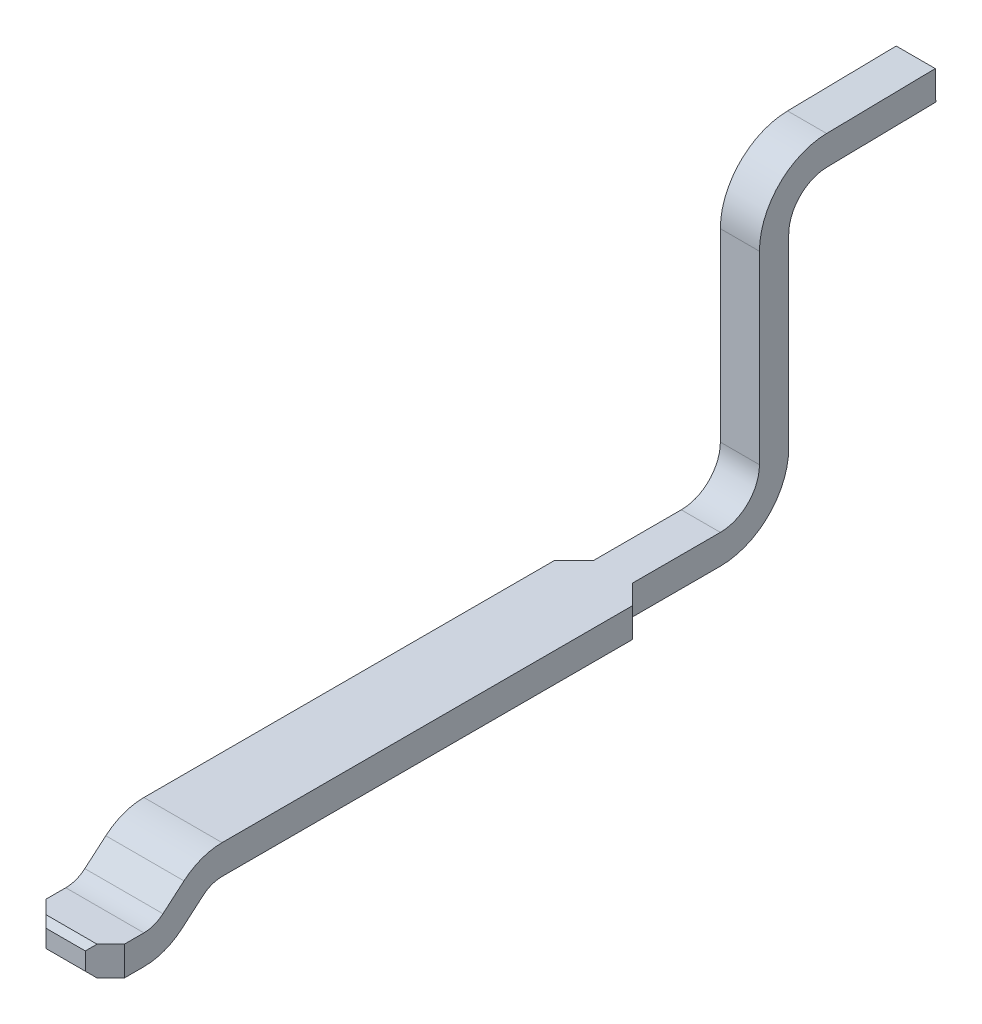
ISO-10303-21;
HEADER;
FILE_DESCRIPTION(('STEP AP214'),'2;1');
FILE_NAME('part.step','',(''),(''),'','','');
FILE_SCHEMA(('AUTOMOTIVE_DESIGN { 1 0 10303 214 1 1 1 1 }'));
ENDSEC;
DATA;
#1=APPLICATION_CONTEXT('core data for automotive mechanical design processes');
#2=APPLICATION_PROTOCOL_DEFINITION('international standard','automotive_design',2000,#1);
#3=PRODUCT_CONTEXT('',#1,'mechanical');
#4=PRODUCT('Part','Part','',(#3));
#5=PRODUCT_RELATED_PRODUCT_CATEGORY('part','',(#4));
#6=PRODUCT_DEFINITION_FORMATION('','',#4);
#7=PRODUCT_DEFINITION_CONTEXT('part definition',#1,'design');
#8=PRODUCT_DEFINITION('design','',#6,#7);
#9=PRODUCT_DEFINITION_SHAPE('','',#8);
#10=(LENGTH_UNIT() NAMED_UNIT(*) SI_UNIT(.MILLI.,.METRE.));
#11=(NAMED_UNIT(*) PLANE_ANGLE_UNIT() SI_UNIT($,.RADIAN.));
#12=(NAMED_UNIT(*) SI_UNIT($,.STERADIAN.) SOLID_ANGLE_UNIT());
#13=UNCERTAINTY_MEASURE_WITH_UNIT(LENGTH_MEASURE(1.E-05),#10,'distance_accuracy_value','');
#14=(GEOMETRIC_REPRESENTATION_CONTEXT(3) GLOBAL_UNCERTAINTY_ASSIGNED_CONTEXT((#13)) GLOBAL_UNIT_ASSIGNED_CONTEXT((#10,
#11,#12)) REPRESENTATION_CONTEXT('',''));
#15=CARTESIAN_POINT('',(0.,0.,0.));
#16=DIRECTION('',(0.,0.,1.));
#17=DIRECTION('',(1.,0.,0.));
#18=AXIS2_PLACEMENT_3D('',#15,#16,#17);
#19=CARTESIAN_POINT('',(3.15403496496787,8.074228109921,4.324047830079));
#20=DIRECTION('',(0.,0.707106781186548,0.707106781186548));
#21=DIRECTION('',(0.,-0.707106781186548,0.707106781186548));
#22=AXIS2_PLACEMENT_3D('',#19,#20,#21);
#23=PLANE('',#22);
#24=DIRECTION('',(-0.577350269189631,0.577350269189615,-0.577350269189631));
#25=VECTOR('',#24,1.);
#26=CARTESIAN_POINT('',(3.18973309999987,8.04019892,4.35807702));
#27=LINE('',#26,#25);
#28=CARTESIAN_POINT('',(3.18973309999987,8.04019892,4.35807702));
#29=VERTEX_POINT('',#28);
#30=CARTESIAN_POINT('',(3.15973309999987,8.07019892,4.32807702));
#31=VERTEX_POINT('',#30);
#32=EDGE_CURVE('E186',#29,#31,#27,.T.);
#33=ORIENTED_EDGE('',*,*,#32,.F.);
#34=DIRECTION('',(-1.,0.,0.));
#35=VECTOR('',#34,1.);
#36=CARTESIAN_POINT('',(3.39543123503187,8.04019892,4.35807702));
#37=LINE('',#36,#35);
#38=CARTESIAN_POINT('',(3.38973309999987,8.04019892,4.35807702));
#39=VERTEX_POINT('',#38);
#40=EDGE_CURVE('E179',#29,#39,#37,.F.);
#41=ORIENTED_EDGE('',*,*,#40,.T.);
#42=DIRECTION('',(-0.577350269189637,-0.577350269189604,0.577350269189637));
#43=VECTOR('',#42,1.);
#44=CARTESIAN_POINT('',(3.41973309999987,8.07019892,4.32807702));
#45=LINE('',#44,#43);
#46=CARTESIAN_POINT('',(3.41973309999987,8.07019892,4.32807702));
#47=VERTEX_POINT('',#46);
#48=EDGE_CURVE('E302',#47,#39,#45,.T.);
#49=ORIENTED_EDGE('',*,*,#48,.F.);
#50=DIRECTION('',(1.,0.,0.));
#51=VECTOR('',#50,1.);
#52=CARTESIAN_POINT('',(3.49773309999987,8.07019892,4.32807702));
#53=LINE('',#52,#51);
#54=EDGE_CURVE('E309',#31,#47,#53,.T.);
#55=ORIENTED_EDGE('',*,*,#54,.F.);
#56=EDGE_LOOP('',(#33,#41,#49,#55));
#57=FACE_BOUND('',#56,.T.);
#58=ADVANCED_FACE('F17',(#57),#23,.T.);
#59=CARTESIAN_POINT('',(3.39543123503187,7.944500784968,4.35807702));
#60=DIRECTION('',(0.,0.,-1.));
#61=DIRECTION('',(-1.,0.,0.));
#62=AXIS2_PLACEMENT_3D('',#59,#60,#61);
#63=PLANE('',#62);
#64=DIRECTION('',(0.,1.,0.));
#65=VECTOR('',#64,1.);
#66=CARTESIAN_POINT('',(3.38973309999987,7.914500784968,4.35807702));
#67=LINE('',#66,#65);
#68=CARTESIAN_POINT('',(3.38973309999987,7.95019892,4.35807702));
#69=VERTEX_POINT('',#68);
#70=EDGE_CURVE('E289',#39,#69,#67,.F.);
#71=ORIENTED_EDGE('',*,*,#70,.F.);
#72=ORIENTED_EDGE('',*,*,#40,.F.);
#73=DIRECTION('',(0.,1.,0.));
#74=VECTOR('',#73,1.);
#75=CARTESIAN_POINT('',(3.18973309999987,7.914500784968,4.35807702));
#76=LINE('',#75,#74);
#77=CARTESIAN_POINT('',(3.18973309999987,7.95019892,4.35807702));
#78=VERTEX_POINT('',#77);
#79=EDGE_CURVE('E368',#78,#29,#76,.T.);
#80=ORIENTED_EDGE('',*,*,#79,.F.);
#81=DIRECTION('',(1.,0.,0.));
#82=VECTOR('',#81,1.);
#83=CARTESIAN_POINT('',(3.42543123503187,7.95019892,4.35807702));
#84=LINE('',#83,#82);
#85=EDGE_CURVE('E359',#69,#78,#84,.F.);
#86=ORIENTED_EDGE('',*,*,#85,.F.);
#87=EDGE_LOOP('',(#71,#72,#80,#86));
#88=FACE_BOUND('',#87,.T.);
#89=ADVANCED_FACE('F778',(#88),#63,.F.);
#90=CARTESIAN_POINT('',(3.42543123503187,7.916169730079,4.324047830079));
#91=DIRECTION('',(0.,-0.707106781186548,0.707106781186548));
#92=DIRECTION('',(0.,-0.707106781186548,-0.707106781186548));
#93=AXIS2_PLACEMENT_3D('',#90,#91,#92);
#94=PLANE('',#93);
#95=DIRECTION('',(0.577350269189626,-0.577350269189626,-0.577350269189626));
#96=VECTOR('',#95,1.);
#97=CARTESIAN_POINT('',(3.38973309999987,7.95019892,4.35807702));
#98=LINE('',#97,#96);
#99=CARTESIAN_POINT('',(3.41973309999987,7.92019892,4.32807702));
#100=VERTEX_POINT('',#99);
#101=EDGE_CURVE('E303',#69,#100,#98,.T.);
#102=ORIENTED_EDGE('',*,*,#101,.F.);
#103=ORIENTED_EDGE('',*,*,#85,.T.);
#104=DIRECTION('',(0.57735026918962,0.577350269189637,0.57735026918962));
#105=VECTOR('',#104,1.);
#106=CARTESIAN_POINT('',(3.15973309999987,7.92019892,4.32807702));
#107=LINE('',#106,#105);
#108=CARTESIAN_POINT('',(3.15973309999987,7.92019892,4.32807702));
#109=VERTEX_POINT('',#108);
#110=EDGE_CURVE('E344',#109,#78,#107,.T.);
#111=ORIENTED_EDGE('',*,*,#110,.F.);
#112=DIRECTION('',(1.,0.,0.));
#113=VECTOR('',#112,1.);
#114=CARTESIAN_POINT('',(3.49773309999987,7.92019892,4.32807702));
#115=LINE('',#114,#113);
#116=EDGE_CURVE('E284',#109,#100,#115,.T.);
#117=ORIENTED_EDGE('',*,*,#116,.T.);
#118=EDGE_LOOP('',(#102,#103,#111,#117));
#119=FACE_BOUND('',#118,.T.);
#120=ADVANCED_FACE('F771',(#119),#94,.T.);
#121=CARTESIAN_POINT('',(3.39543123503187,8.45127780084181,0.758077020000001));
#122=DIRECTION('',(0.,0.,-1.));
#123=DIRECTION('',(-1.,0.,0.));
#124=AXIS2_PLACEMENT_3D('',#121,#122,#123);
#125=PLANE('',#124);
#126=DIRECTION('',(0.,1.,0.));
#127=VECTOR('',#126,1.);
#128=CARTESIAN_POINT('',(3.38973309999987,9.610333059471,0.758077020000001));
#129=LINE('',#128,#127);
#130=CARTESIAN_POINT('',(3.38973309999987,8.47019892,0.758077020000001));
#131=VERTEX_POINT('',#130);
#132=CARTESIAN_POINT('',(3.38973309999987,9.41625487791,0.758077020000001));
#133=VERTEX_POINT('',#132);
#134=EDGE_CURVE('E253',#131,#133,#129,.T.);
#135=ORIENTED_EDGE('',*,*,#134,.F.);
#136=DIRECTION('',(-1.,0.,0.));
#137=VECTOR('',#136,1.);
#138=CARTESIAN_POINT('',(3.38973309999987,8.47019892,0.75807702));
#139=LINE('',#138,#137);
#140=CARTESIAN_POINT('',(3.18973309999987,8.47019892,0.758077020000001));
#141=VERTEX_POINT('',#140);
#142=EDGE_CURVE('E361',#141,#131,#139,.F.);
#143=ORIENTED_EDGE('',*,*,#142,.F.);
#144=DIRECTION('',(0.,1.,0.));
#145=VECTOR('',#144,1.);
#146=CARTESIAN_POINT('',(3.18973309999987,8.45127780084181,0.758077020000001));
#147=LINE('',#146,#145);
#148=CARTESIAN_POINT('',(3.18973309999987,9.41625487791,0.758077020000001));
#149=VERTEX_POINT('',#148);
#150=EDGE_CURVE('E235',#149,#141,#147,.F.);
#151=ORIENTED_EDGE('',*,*,#150,.F.);
#152=DIRECTION('',(1.,0.,0.));
#153=VECTOR('',#152,1.);
#154=CARTESIAN_POINT('',(3.18973309999987,9.41625487791,0.758077020000001));
#155=LINE('',#154,#153);
#156=EDGE_CURVE('E342',#149,#133,#155,.T.);
#157=ORIENTED_EDGE('',*,*,#156,.T.);
#158=EDGE_LOOP('',(#135,#143,#151,#157));
#159=FACE_BOUND('',#158,.T.);
#160=ADVANCED_FACE('F474',(#159),#125,.T.);
#161=CARTESIAN_POINT('',(3.38973309999987,8.47019892,1.10807702));
#162=DIRECTION('',(-1.,0.,0.));
#163=DIRECTION('',(0.,0.,1.));
#164=AXIS2_PLACEMENT_3D('',#161,#162,#163);
#165=CYLINDRICAL_SURFACE('',#164,0.2);
#166=DIRECTION('',(1.,0.,0.));
#167=VECTOR('',#166,1.);
#168=CARTESIAN_POINT('',(3.49773309999987,8.27019892,1.10807702));
#169=LINE('',#168,#167);
#170=CARTESIAN_POINT('',(3.38973309999987,8.27019892,1.10807702));
#171=VERTEX_POINT('',#170);
#172=CARTESIAN_POINT('',(3.18973309999987,8.27019892,1.10807702));
#173=VERTEX_POINT('',#172);
#174=EDGE_CURVE('E317',#171,#173,#169,.F.);
#175=ORIENTED_EDGE('',*,*,#174,.F.);
#176=CARTESIAN_POINT('',(3.38973309999987,8.47019892,1.10807702));
#177=DIRECTION('',(-1.,0.,0.));
#178=DIRECTION('',(0.,0.,1.));
#179=AXIS2_PLACEMENT_3D('',#176,#177,#178);
#180=CIRCLE('',#179,0.2);
#181=CARTESIAN_POINT('',(3.38973309999987,8.47019892,0.908077020000001));
#182=VERTEX_POINT('',#181);
#183=EDGE_CURVE('E259',#182,#171,#180,.T.);
#184=ORIENTED_EDGE('',*,*,#183,.F.);
#185=DIRECTION('',(-1.,0.,0.));
#186=VECTOR('',#185,1.);
#187=CARTESIAN_POINT('',(3.39543123503187,8.47019892,0.908077020000001));
#188=LINE('',#187,#186);
#189=CARTESIAN_POINT('',(3.18973309999987,8.47019892,0.908077020000001));
#190=VERTEX_POINT('',#189);
#191=EDGE_CURVE('E356',#182,#190,#188,.T.);
#192=ORIENTED_EDGE('',*,*,#191,.T.);
#193=CARTESIAN_POINT('',(3.18973309999987,8.47019892,1.10807702));
#194=DIRECTION('',(-1.,0.,0.));
#195=DIRECTION('',(0.,0.,1.));
#196=AXIS2_PLACEMENT_3D('',#193,#194,#195);
#197=CIRCLE('',#196,0.2);
#198=EDGE_CURVE('E228',#173,#190,#197,.F.);
#199=ORIENTED_EDGE('',*,*,#198,.F.);
#200=EDGE_LOOP('',(#175,#184,#192,#199));
#201=FACE_BOUND('',#200,.T.);
#202=ADVANCED_FACE('F441',(#201),#165,.F.);
#203=CARTESIAN_POINT('',(3.39543123503187,8.45127780084181,0.908077020000001));
#204=DIRECTION('',(0.,0.,-1.));
#205=DIRECTION('',(-1.,0.,0.));
#206=AXIS2_PLACEMENT_3D('',#203,#204,#205);
#207=PLANE('',#206);
#208=ORIENTED_EDGE('',*,*,#191,.F.);
#209=DIRECTION('',(0.,1.,0.));
#210=VECTOR('',#209,1.);
#211=CARTESIAN_POINT('',(3.38973309999987,9.610333059471,0.908077020000001));
#212=LINE('',#211,#210);
#213=CARTESIAN_POINT('',(3.38973309999987,9.41625487791,0.908077020000001));
#214=VERTEX_POINT('',#213);
#215=EDGE_CURVE('E262',#214,#182,#212,.F.);
#216=ORIENTED_EDGE('',*,*,#215,.F.);
#217=DIRECTION('',(1.,0.,0.));
#218=VECTOR('',#217,1.);
#219=CARTESIAN_POINT('',(3.18973309999987,9.41625487791,0.908077020000001));
#220=LINE('',#219,#218);
#221=CARTESIAN_POINT('',(3.18973309999987,9.41625487791,0.908077020000001));
#222=VERTEX_POINT('',#221);
#223=EDGE_CURVE('E354',#222,#214,#220,.T.);
#224=ORIENTED_EDGE('',*,*,#223,.F.);
#225=DIRECTION('',(0.,1.,0.));
#226=VECTOR('',#225,1.);
#227=CARTESIAN_POINT('',(3.18973309999987,8.45127780084181,0.908077020000001));
#228=LINE('',#227,#226);
#229=EDGE_CURVE('E226',#190,#222,#228,.T.);
#230=ORIENTED_EDGE('',*,*,#229,.F.);
#231=EDGE_LOOP('',(#208,#216,#224,#230));
#232=FACE_BOUND('',#231,.T.);
#233=ADVANCED_FACE('F750',(#232),#207,.F.);
#234=CARTESIAN_POINT('',(3.18973309999987,9.41625487791,0.558077020000001));
#235=DIRECTION('',(1.,0.,0.));
#236=DIRECTION('',(0.,0.,-1.));
#237=AXIS2_PLACEMENT_3D('',#234,#235,#236);
#238=CYLINDRICAL_SURFACE('',#237,0.35);
#239=ORIENTED_EDGE('',*,*,#223,.T.);
#240=CARTESIAN_POINT('',(3.38973309999987,9.41625487791,0.558077020000001));
#241=DIRECTION('',(1.,0.,0.));
#242=DIRECTION('',(0.,0.,-1.));
#243=AXIS2_PLACEMENT_3D('',#240,#241,#242);
#244=CIRCLE('',#243,0.35);
#245=CARTESIAN_POINT('',(3.38973309999987,9.76620157121429,0.564185362253241));
#246=VERTEX_POINT('',#245);
#247=EDGE_CURVE('E20',#246,#214,#244,.T.);
#248=ORIENTED_EDGE('',*,*,#247,.F.);
#249=DIRECTION('',(1.,0.,0.));
#250=VECTOR('',#249,1.);
#251=CARTESIAN_POINT('',(3.18403496496787,9.76620157121458,0.564185362253011));
#252=LINE('',#251,#250);
#253=CARTESIAN_POINT('',(3.18973309999987,9.76620157121429,0.564185362253241));
#254=VERTEX_POINT('',#253);
#255=EDGE_CURVE('E143',#254,#246,#252,.T.);
#256=ORIENTED_EDGE('',*,*,#255,.F.);
#257=CARTESIAN_POINT('',(3.18973309999987,9.41625487791,0.558077020000001));
#258=DIRECTION('',(1.,0.,0.));
#259=DIRECTION('',(0.,0.,-1.));
#260=AXIS2_PLACEMENT_3D('',#257,#258,#259);
#261=CIRCLE('',#260,0.35);
#262=EDGE_CURVE('E223',#222,#254,#261,.F.);
#263=ORIENTED_EDGE('',*,*,#262,.F.);
#264=EDGE_LOOP('',(#239,#248,#256,#263));
#265=FACE_BOUND('',#264,.T.);
#266=ADVANCED_FACE('F743',(#265),#238,.T.);
#267=CARTESIAN_POINT('',(3.18403496496787,9.766007480923,0.575304787611001));
#268=DIRECTION('',(0.,0.999847695156406,0.0174524064364471));
#269=DIRECTION('',(0.,-0.0174524064364471,0.999847695156406));
#270=AXIS2_PLACEMENT_3D('',#267,#268,#269);
#271=PLANE('',#270);
#272=DIRECTION('',(0.,0.0174524064385203,-0.99984769515637));
#273=VECTOR('',#272,1.);
#274=CARTESIAN_POINT('',(3.18973309999987,9.766201571214,0.564185362253001));
#275=LINE('',#274,#273);
#276=CARTESIAN_POINT('',(3.18973309999987,9.775906085794,0.00821409435916126));
#277=VERTEX_POINT('',#276);
#278=EDGE_CURVE('E199',#254,#277,#275,.T.);
#279=ORIENTED_EDGE('',*,*,#278,.F.);
#280=ORIENTED_EDGE('',*,*,#255,.T.);
#281=DIRECTION('',(0.,-0.0174524064385203,0.99984769515637));
#282=VECTOR('',#281,1.);
#283=CARTESIAN_POINT('',(3.38973309999987,9.775906085794,0.00821409435900074));
#284=LINE('',#283,#282);
#285=CARTESIAN_POINT('',(3.38973309999987,9.775906085794,0.00821409435916126));
#286=VERTEX_POINT('',#285);
#287=EDGE_CURVE('E265',#286,#246,#284,.T.);
#288=ORIENTED_EDGE('',*,*,#287,.F.);
#289=DIRECTION('',(1.,0.,0.));
#290=VECTOR('',#289,1.);
#291=CARTESIAN_POINT('',(3.39543123503187,9.77590608579399,0.0082140943594823));
#292=LINE('',#291,#290);
#293=EDGE_CURVE('E153',#277,#286,#292,.T.);
#294=ORIENTED_EDGE('',*,*,#293,.F.);
#295=EDGE_LOOP('',(#279,#280,#288,#294));
#296=FACE_BOUND('',#295,.T.);
#297=ADVANCED_FACE('F736',(#296),#271,.T.);
#298=CARTESIAN_POINT('',(3.39543123503187,9.620231664342,0.00549678722500089));
#299=DIRECTION('',(0.,0.0174524064396861,-0.999847695156349));
#300=DIRECTION('',(0.,0.999847695156349,0.0174524064396861));
#301=AXIS2_PLACEMENT_3D('',#298,#299,#300);
#302=PLANE('',#301);
#303=DIRECTION('',(1.,0.,0.));
#304=VECTOR('',#303,1.);
#305=CARTESIAN_POINT('',(3.18403496496787,9.62592893152041,0.00559623339400797));
#306=LINE('',#305,#304);
#307=CARTESIAN_POINT('',(3.38973309999987,9.62592893152018,0.00559623339400417));
#308=VERTEX_POINT('',#307);
#309=CARTESIAN_POINT('',(3.18973309999987,9.62592893152014,0.00559623339400334));
#310=VERTEX_POINT('',#309);
#311=EDGE_CURVE('E202',#308,#310,#306,.F.);
#312=ORIENTED_EDGE('',*,*,#311,.T.);
#313=DIRECTION('',(0.,-0.999847695156461,-0.0174524064332696));
#314=VECTOR('',#313,1.);
#315=CARTESIAN_POINT('',(3.18973309999987,9.775906085794,0.00821409435900074));
#316=LINE('',#315,#314);
#317=EDGE_CURVE('E192',#277,#310,#316,.T.);
#318=ORIENTED_EDGE('',*,*,#317,.F.);
#319=ORIENTED_EDGE('',*,*,#293,.T.);
#320=DIRECTION('',(0.,0.999847695156461,0.0174524064332696));
#321=VECTOR('',#320,1.);
#322=CARTESIAN_POINT('',(3.38973309999987,9.62592893152,0.00559623339400103));
#323=LINE('',#322,#321);
#324=EDGE_CURVE('E204',#308,#286,#323,.T.);
#325=ORIENTED_EDGE('',*,*,#324,.F.);
#326=EDGE_LOOP('',(#312,#318,#319,#325));
#327=FACE_BOUND('',#326,.T.);
#328=ADVANCED_FACE('F203',(#327),#302,.T.);
#329=CARTESIAN_POINT('',(3.18403496496787,9.616030326649,0.572686926645001));
#330=DIRECTION('',(0.,0.999847695156375,0.0174524064382066));
#331=DIRECTION('',(0.,-0.0174524064382066,0.999847695156375));
#332=AXIS2_PLACEMENT_3D('',#329,#330,#331);
#333=PLANE('',#332);
#334=DIRECTION('',(1.,0.,0.));
#335=VECTOR('',#334,1.);
#336=CARTESIAN_POINT('',(3.18973309999987,9.61622441694128,0.561567501287006));
#337=LINE('',#336,#335);
#338=CARTESIAN_POINT('',(3.38973309999987,9.61622441694114,0.561567501287176));
#339=VERTEX_POINT('',#338);
#340=CARTESIAN_POINT('',(3.18973309999987,9.61622441694114,0.561567501287176));
#341=VERTEX_POINT('',#340);
#342=EDGE_CURVE('E208',#339,#341,#337,.F.);
#343=ORIENTED_EDGE('',*,*,#342,.T.);
#344=DIRECTION('',(0.,-0.0174524064367521,0.999847695156401));
#345=VECTOR('',#344,1.);
#346=CARTESIAN_POINT('',(3.18973309999987,9.62592893152,0.00559623339400103));
#347=LINE('',#346,#345);
#348=EDGE_CURVE('E197',#310,#341,#347,.T.);
#349=ORIENTED_EDGE('',*,*,#348,.F.);
#350=ORIENTED_EDGE('',*,*,#311,.F.);
#351=DIRECTION('',(0.,0.0174524064367521,-0.999847695156401));
#352=VECTOR('',#351,1.);
#353=CARTESIAN_POINT('',(3.38973309999987,9.616224416941,0.561567501287001));
#354=LINE('',#353,#352);
#355=EDGE_CURVE('E248',#339,#308,#354,.T.);
#356=ORIENTED_EDGE('',*,*,#355,.F.);
#357=EDGE_LOOP('',(#343,#349,#350,#356));
#358=FACE_BOUND('',#357,.T.);
#359=ADVANCED_FACE('F210',(#358),#333,.F.);
#360=CARTESIAN_POINT('',(3.18973309999987,9.41625487791,0.558077020000001));
#361=DIRECTION('',(1.,0.,0.));
#362=DIRECTION('',(0.,0.,-1.));
#363=AXIS2_PLACEMENT_3D('',#360,#361,#362);
#364=CYLINDRICAL_SURFACE('',#363,0.2);
#365=ORIENTED_EDGE('',*,*,#156,.F.);
#366=CARTESIAN_POINT('',(3.18973309999987,9.41625487791,0.558077020000001));
#367=DIRECTION('',(1.,0.,0.));
#368=DIRECTION('',(0.,0.,-1.));
#369=AXIS2_PLACEMENT_3D('',#366,#367,#368);
#370=CIRCLE('',#369,0.2);
#371=EDGE_CURVE('E212',#341,#149,#370,.T.);
#372=ORIENTED_EDGE('',*,*,#371,.F.);
#373=ORIENTED_EDGE('',*,*,#342,.F.);
#374=CARTESIAN_POINT('',(3.38973309999987,9.41625487791,0.558077020000001));
#375=DIRECTION('',(1.,0.,0.));
#376=DIRECTION('',(0.,0.,-1.));
#377=AXIS2_PLACEMENT_3D('',#374,#375,#376);
#378=CIRCLE('',#377,0.2);
#379=EDGE_CURVE('E250',#133,#339,#378,.F.);
#380=ORIENTED_EDGE('',*,*,#379,.F.);
#381=EDGE_LOOP('',(#365,#372,#373,#380));
#382=FACE_BOUND('',#381,.T.);
#383=ADVANCED_FACE('F476',(#382),#364,.F.);
#384=CARTESIAN_POINT('',(3.08570391007887,7.914500784968,4.254047830079));
#385=DIRECTION('',(-0.707106781186548,0.,0.707106781186548));
#386=DIRECTION('',(0.707106781186548,0.,0.707106781186548));
#387=AXIS2_PLACEMENT_3D('',#384,#385,#386);
#388=PLANE('',#387);
#389=DIRECTION('',(0.,1.,0.));
#390=VECTOR('',#389,1.);
#391=CARTESIAN_POINT('',(3.08973309999987,7.914500784968,4.25807702));
#392=LINE('',#391,#390);
#393=CARTESIAN_POINT('',(3.08973309999987,8.07019892,4.25807702));
#394=VERTEX_POINT('',#393);
#395=CARTESIAN_POINT('',(3.08973309999987,7.92019892,4.25807702));
#396=VERTEX_POINT('',#395);
#397=EDGE_CURVE('E332',#394,#396,#392,.F.);
#398=ORIENTED_EDGE('',*,*,#397,.T.);
#399=DIRECTION('',(0.707106781186543,0.,0.707106781186552));
#400=VECTOR('',#399,1.);
#401=CARTESIAN_POINT('',(3.08973309999987,7.92019892,4.25807702));
#402=LINE('',#401,#400);
#403=EDGE_CURVE('E288',#396,#109,#402,.T.);
#404=ORIENTED_EDGE('',*,*,#403,.T.);
#405=ORIENTED_EDGE('',*,*,#110,.T.);
#406=ORIENTED_EDGE('',*,*,#79,.T.);
#407=ORIENTED_EDGE('',*,*,#32,.T.);
#408=DIRECTION('',(0.707106781186543,0.,0.707106781186552));
#409=VECTOR('',#408,1.);
#410=CARTESIAN_POINT('',(3.08973309999987,8.07019892,4.25807702));
#411=LINE('',#410,#409);
#412=EDGE_CURVE('E308',#394,#31,#411,.T.);
#413=ORIENTED_EDGE('',*,*,#412,.F.);
#414=EDGE_LOOP('',(#398,#404,#405,#406,#407,#413));
#415=FACE_BOUND('',#414,.T.);
#416=ADVANCED_FACE('F565',(#415),#388,.T.);
#417=CARTESIAN_POINT('',(3.49773309999987,8.27019892,3.81107702));
#418=DIRECTION('',(0.,1.,0.));
#419=DIRECTION('',(0.,0.,1.));
#420=AXIS2_PLACEMENT_3D('',#417,#418,#419);
#421=PLANE('',#420);
#422=DIRECTION('',(0.,0.,-1.));
#423=VECTOR('',#422,1.);
#424=CARTESIAN_POINT('',(3.48973309999987,8.27019892,3.80007702));
#425=LINE('',#424,#423);
#426=CARTESIAN_POINT('',(3.48973309999987,8.27019892,1.65807702));
#427=VERTEX_POINT('',#426);
#428=CARTESIAN_POINT('',(3.48973309999987,8.27019892,3.75807702));
#429=VERTEX_POINT('',#428);
#430=EDGE_CURVE('E411',#427,#429,#425,.F.);
#431=ORIENTED_EDGE('',*,*,#430,.F.);
#432=DIRECTION('',(-0.707106781186548,0.,-0.707106781186548));
#433=VECTOR('',#432,1.);
#434=CARTESIAN_POINT('',(3.38570391007887,8.27019892,1.554047830079));
#435=LINE('',#434,#433);
#436=CARTESIAN_POINT('',(3.38973309999987,8.27019892,1.55807702));
#437=VERTEX_POINT('',#436);
#438=EDGE_CURVE('E267',#437,#427,#435,.F.);
#439=ORIENTED_EDGE('',*,*,#438,.F.);
#440=DIRECTION('',(0.,0.,-1.));
#441=VECTOR('',#440,1.);
#442=CARTESIAN_POINT('',(3.38973309999987,8.27019892,0.572587480477));
#443=LINE('',#442,#441);
#444=EDGE_CURVE('E256',#171,#437,#443,.F.);
#445=ORIENTED_EDGE('',*,*,#444,.F.);
#446=ORIENTED_EDGE('',*,*,#174,.T.);
#447=DIRECTION('',(0.,0.,1.));
#448=VECTOR('',#447,1.);
#449=CARTESIAN_POINT('',(3.18973309999987,8.27019892,0.913775155032));
#450=LINE('',#449,#448);
#451=CARTESIAN_POINT('',(3.18973309999987,8.27019892,1.55807702));
#452=VERTEX_POINT('',#451);
#453=EDGE_CURVE('E229',#452,#173,#450,.F.);
#454=ORIENTED_EDGE('',*,*,#453,.F.);
#455=DIRECTION('',(-0.707106781186548,0.,0.707106781186548));
#456=VECTOR('',#455,1.);
#457=CARTESIAN_POINT('',(3.08570391007887,8.27019892,1.662106209921));
#458=LINE('',#457,#456);
#459=CARTESIAN_POINT('',(3.08973309999987,8.27019892,1.65807702));
#460=VERTEX_POINT('',#459);
#461=EDGE_CURVE('E322',#460,#452,#458,.F.);
#462=ORIENTED_EDGE('',*,*,#461,.F.);
#463=DIRECTION('',(0.,0.,-1.));
#464=VECTOR('',#463,1.);
#465=CARTESIAN_POINT('',(3.08973309999987,8.27019892,4.163775155032));
#466=LINE('',#465,#464);
#467=CARTESIAN_POINT('',(3.08973309999987,8.27019892,3.75807702));
#468=VERTEX_POINT('',#467);
#469=EDGE_CURVE('E421',#460,#468,#466,.F.);
#470=ORIENTED_EDGE('',*,*,#469,.T.);
#471=DIRECTION('',(-1.,0.,0.));
#472=VECTOR('',#471,1.);
#473=CARTESIAN_POINT('',(3.48973309999987,8.27019892,3.75807702));
#474=LINE('',#473,#472);
#475=EDGE_CURVE('E315',#429,#468,#474,.T.);
#476=ORIENTED_EDGE('',*,*,#475,.F.);
#477=EDGE_LOOP('',(#431,#439,#445,#446,#454,#462,#470,#476));
#478=FACE_BOUND('',#477,.T.);
#479=ADVANCED_FACE('F445',(#478),#421,.T.);
#480=CARTESIAN_POINT('',(3.48973309999987,7.97019892,3.75807702));
#481=DIRECTION('',(-1.,0.,0.));
#482=DIRECTION('',(0.,0.,1.));
#483=AXIS2_PLACEMENT_3D('',#480,#481,#482);
#484=CYLINDRICAL_SURFACE('',#483,0.3);
#485=CARTESIAN_POINT('',(3.08973309999987,7.97019892,3.75807702));
#486=DIRECTION('',(-1.,0.,0.));
#487=DIRECTION('',(0.,0.,1.));
#488=AXIS2_PLACEMENT_3D('',#485,#486,#487);
#489=CIRCLE('',#488,0.3);
#490=CARTESIAN_POINT('',(3.08973309999987,8.19815650538647,3.9531035291326));
#491=VERTEX_POINT('',#490);
#492=EDGE_CURVE('E418',#468,#491,#489,.F.);
#493=ORIENTED_EDGE('',*,*,#492,.T.);
#494=DIRECTION('',(1.,0.,0.));
#495=VECTOR('',#494,1.);
#496=CARTESIAN_POINT('',(3.49773309999987,8.19815650538616,3.95310352913313));
#497=LINE('',#496,#495);
#498=CARTESIAN_POINT('',(3.48973309999987,8.19815650538647,3.9531035291326));
#499=VERTEX_POINT('',#498);
#500=EDGE_CURVE('E313',#499,#491,#497,.F.);
#501=ORIENTED_EDGE('',*,*,#500,.F.);
#502=CARTESIAN_POINT('',(3.48973309999987,7.97019892,3.75807702));
#503=DIRECTION('',(-1.,0.,0.));
#504=DIRECTION('',(0.,0.,1.));
#505=AXIS2_PLACEMENT_3D('',#502,#503,#504);
#506=CIRCLE('',#505,0.3);
#507=EDGE_CURVE('E409',#429,#499,#506,.F.);
#508=ORIENTED_EDGE('',*,*,#507,.F.);
#509=ORIENTED_EDGE('',*,*,#475,.T.);
#510=EDGE_LOOP('',(#493,#501,#508,#509));
#511=FACE_BOUND('',#510,.T.);
#512=ADVANCED_FACE('F585',(#511),#484,.T.);
#513=CARTESIAN_POINT('',(3.49773309999987,8.102515836027,4.064893542443));
#514=DIRECTION('',(0.,0.759858617954068,0.650088363779058));
#515=DIRECTION('',(0.,-0.650088363779058,0.759858617954068));
#516=AXIS2_PLACEMENT_3D('',#513,#514,#515);
#517=PLANE('',#516);
#518=DIRECTION('',(0.,-0.650088363774947,0.759858617957586));
#519=VECTOR('',#518,1.);
#520=CARTESIAN_POINT('',(3.08973309999987,8.198156505386,3.953103529133));
#521=LINE('',#520,#519);
#522=CARTESIAN_POINT('',(3.08973309999987,8.10622012730668,4.06056376543338));
#523=VERTEX_POINT('',#522);
#524=EDGE_CURVE('E417',#491,#523,#521,.T.);
#525=ORIENTED_EDGE('',*,*,#524,.T.);
#526=DIRECTION('',(-1.,0.,0.));
#527=VECTOR('',#526,1.);
#528=CARTESIAN_POINT('',(3.48973309999987,8.10622012730701,4.06056376543301));
#529=LINE('',#528,#527);
#530=CARTESIAN_POINT('',(3.48973309999987,8.10622012730668,4.06056376543338));
#531=VERTEX_POINT('',#530);
#532=EDGE_CURVE('E310',#523,#531,#529,.F.);
#533=ORIENTED_EDGE('',*,*,#532,.T.);
#534=DIRECTION('',(0.,-0.650088363774947,0.759858617957586));
#535=VECTOR('',#534,1.);
#536=CARTESIAN_POINT('',(3.48973309999987,8.198156505386,3.953103529133));
#537=LINE('',#536,#535);
#538=EDGE_CURVE('E408',#499,#531,#537,.T.);
#539=ORIENTED_EDGE('',*,*,#538,.F.);
#540=ORIENTED_EDGE('',*,*,#500,.T.);
#541=EDGE_LOOP('',(#525,#533,#539,#540));
#542=FACE_BOUND('',#541,.T.);
#543=ADVANCED_FACE('F580',(#542),#517,.T.);
#544=CARTESIAN_POINT('',(3.48973309999987,8.22019892,4.15807702));
#545=DIRECTION('',(-1.,0.,0.));
#546=DIRECTION('',(0.,0.,1.));
#547=AXIS2_PLACEMENT_3D('',#544,#545,#546);
#548=CYLINDRICAL_SURFACE('',#547,0.15);
#549=CARTESIAN_POINT('',(3.08973309999987,8.22019892,4.15807702));
#550=DIRECTION('',(-1.,0.,0.));
#551=DIRECTION('',(0.,0.,1.));
#552=AXIS2_PLACEMENT_3D('',#549,#550,#551);
#553=CIRCLE('',#552,0.15);
#554=CARTESIAN_POINT('',(3.08973309999987,8.07019892,4.15807702));
#555=VERTEX_POINT('',#554);
#556=EDGE_CURVE('E414',#523,#555,#553,.T.);
#557=ORIENTED_EDGE('',*,*,#556,.T.);
#558=DIRECTION('',(1.,0.,0.));
#559=VECTOR('',#558,1.);
#560=CARTESIAN_POINT('',(3.49773309999987,8.07019892,4.15807702));
#561=LINE('',#560,#559);
#562=CARTESIAN_POINT('',(3.48973309999987,8.07019892,4.15807702));
#563=VERTEX_POINT('',#562);
#564=EDGE_CURVE('E306',#563,#555,#561,.F.);
#565=ORIENTED_EDGE('',*,*,#564,.F.);
#566=CARTESIAN_POINT('',(3.48973309999987,8.22019892,4.15807702));
#567=DIRECTION('',(-1.,0.,0.));
#568=DIRECTION('',(0.,0.,1.));
#569=AXIS2_PLACEMENT_3D('',#566,#567,#568);
#570=CIRCLE('',#569,0.15);
#571=EDGE_CURVE('E406',#531,#563,#570,.T.);
#572=ORIENTED_EDGE('',*,*,#571,.F.);
#573=ORIENTED_EDGE('',*,*,#532,.F.);
#574=EDGE_LOOP('',(#557,#565,#572,#573));
#575=FACE_BOUND('',#574,.T.);
#576=ADVANCED_FACE('F578',(#575),#548,.F.);
#577=CARTESIAN_POINT('',(3.49773309999987,8.07019892,4.333775155032));
#578=DIRECTION('',(0.,1.,0.));
#579=DIRECTION('',(0.,0.,1.));
#580=AXIS2_PLACEMENT_3D('',#577,#578,#579);
#581=PLANE('',#580);
#582=DIRECTION('',(0.,0.,-1.));
#583=VECTOR('',#582,1.);
#584=CARTESIAN_POINT('',(3.08973309999987,8.07019892,4.163775155032));
#585=LINE('',#584,#583);
#586=EDGE_CURVE('E325',#555,#394,#585,.F.);
#587=ORIENTED_EDGE('',*,*,#586,.T.);
#588=ORIENTED_EDGE('',*,*,#412,.T.);
#589=ORIENTED_EDGE('',*,*,#54,.T.);
#590=DIRECTION('',(0.707106781186548,0.,-0.707106781186548));
#591=VECTOR('',#590,1.);
#592=CARTESIAN_POINT('',(3.38570391007887,8.07019892,4.362106209921));
#593=LINE('',#592,#591);
#594=CARTESIAN_POINT('',(3.48973309999987,8.07019892,4.25807702));
#595=VERTEX_POINT('',#594);
#596=EDGE_CURVE('E299',#595,#47,#593,.F.);
#597=ORIENTED_EDGE('',*,*,#596,.F.);
#598=DIRECTION('',(0.,0.,-1.));
#599=VECTOR('',#598,1.);
#600=CARTESIAN_POINT('',(3.48973309999987,8.07019892,3.80007702));
#601=LINE('',#600,#599);
#602=EDGE_CURVE('E296',#563,#595,#601,.F.);
#603=ORIENTED_EDGE('',*,*,#602,.F.);
#604=ORIENTED_EDGE('',*,*,#564,.T.);
#605=EDGE_LOOP('',(#587,#588,#589,#597,#603,#604));
#606=FACE_BOUND('',#605,.T.);
#607=ADVANCED_FACE('F572',(#606),#581,.T.);
#608=CARTESIAN_POINT('',(3.38570391007887,7.914500784968,4.362106209921));
#609=DIRECTION('',(0.707106781186548,0.,0.707106781186548));
#610=DIRECTION('',(0.707106781186548,0.,-0.707106781186548));
#611=AXIS2_PLACEMENT_3D('',#608,#609,#610);
#612=PLANE('',#611);
#613=ORIENTED_EDGE('',*,*,#48,.T.);
#614=ORIENTED_EDGE('',*,*,#70,.T.);
#615=ORIENTED_EDGE('',*,*,#101,.T.);
#616=DIRECTION('',(0.707106781186543,0.,-0.707106781186552));
#617=VECTOR('',#616,1.);
#618=CARTESIAN_POINT('',(3.41973309999987,7.92019892,4.32807702));
#619=LINE('',#618,#617);
#620=CARTESIAN_POINT('',(3.48973309999987,7.92019892,4.25807702));
#621=VERTEX_POINT('',#620);
#622=EDGE_CURVE('E285',#100,#621,#619,.T.);
#623=ORIENTED_EDGE('',*,*,#622,.T.);
#624=DIRECTION('',(0.,1.,0.));
#625=VECTOR('',#624,1.);
#626=CARTESIAN_POINT('',(3.48973309999987,8.114500784968,4.25807702));
#627=LINE('',#626,#625);
#628=EDGE_CURVE('E292',#595,#621,#627,.F.);
#629=ORIENTED_EDGE('',*,*,#628,.F.);
#630=ORIENTED_EDGE('',*,*,#596,.T.);
#631=EDGE_LOOP('',(#613,#614,#615,#623,#629,#630));
#632=FACE_BOUND('',#631,.T.);
#633=ADVANCED_FACE('F589',(#632),#612,.T.);
#634=CARTESIAN_POINT('',(3.49773309999987,7.92019892,4.333775155032));
#635=DIRECTION('',(0.,1.,0.));
#636=DIRECTION('',(0.,0.,1.));
#637=AXIS2_PLACEMENT_3D('',#634,#635,#636);
#638=PLANE('',#637);
#639=ORIENTED_EDGE('',*,*,#403,.F.);
#640=DIRECTION('',(0.,0.,-1.));
#641=VECTOR('',#640,1.);
#642=CARTESIAN_POINT('',(3.08973309999987,7.92019892,4.163775155032));
#643=LINE('',#642,#641);
#644=CARTESIAN_POINT('',(3.08973309999987,7.92019892,4.15807702));
#645=VERTEX_POINT('',#644);
#646=EDGE_CURVE('E335',#396,#645,#643,.T.);
#647=ORIENTED_EDGE('',*,*,#646,.T.);
#648=DIRECTION('',(-1.,0.,0.));
#649=VECTOR('',#648,1.);
#650=CARTESIAN_POINT('',(3.48973309999987,7.92019892,4.15807702));
#651=LINE('',#650,#649);
#652=CARTESIAN_POINT('',(3.48973309999987,7.92019892,4.15807702));
#653=VERTEX_POINT('',#652);
#654=EDGE_CURVE('E282',#653,#645,#651,.T.);
#655=ORIENTED_EDGE('',*,*,#654,.F.);
#656=DIRECTION('',(0.,0.,-1.));
#657=VECTOR('',#656,1.);
#658=CARTESIAN_POINT('',(3.48973309999987,7.92019892,3.80007702));
#659=LINE('',#658,#657);
#660=EDGE_CURVE('E295',#621,#653,#659,.T.);
#661=ORIENTED_EDGE('',*,*,#660,.F.);
#662=ORIENTED_EDGE('',*,*,#622,.F.);
#663=ORIENTED_EDGE('',*,*,#116,.F.);
#664=EDGE_LOOP('',(#639,#647,#655,#661,#662,#663));
#665=FACE_BOUND('',#664,.T.);
#666=ADVANCED_FACE('F596',(#665),#638,.F.);
#667=CARTESIAN_POINT('',(3.48973309999987,8.22019892,4.15807702));
#668=DIRECTION('',(-1.,0.,0.));
#669=DIRECTION('',(0.,0.,1.));
#670=AXIS2_PLACEMENT_3D('',#667,#668,#669);
#671=CYLINDRICAL_SURFACE('',#670,0.3);
#672=CARTESIAN_POINT('',(3.08973309999987,8.22019892,4.15807702));
#673=DIRECTION('',(-1.,0.,0.));
#674=DIRECTION('',(0.,0.,1.));
#675=AXIS2_PLACEMENT_3D('',#672,#673,#674);
#676=CIRCLE('',#675,0.3);
#677=CARTESIAN_POINT('',(3.08973309999987,7.99224133461339,3.96305051086728));
#678=VERTEX_POINT('',#677);
#679=EDGE_CURVE('E422',#645,#678,#676,.F.);
#680=ORIENTED_EDGE('',*,*,#679,.T.);
#681=DIRECTION('',(1.,0.,0.));
#682=VECTOR('',#681,1.);
#683=CARTESIAN_POINT('',(3.49773309999987,7.99224133461357,3.96305051086664));
#684=LINE('',#683,#682);
#685=CARTESIAN_POINT('',(3.48973309999987,7.99224133461339,3.96305051086728));
#686=VERTEX_POINT('',#685);
#687=EDGE_CURVE('E279',#678,#686,#684,.T.);
#688=ORIENTED_EDGE('',*,*,#687,.T.);
#689=CARTESIAN_POINT('',(3.48973309999987,8.22019892,4.15807702));
#690=DIRECTION('',(-1.,0.,0.));
#691=DIRECTION('',(0.,0.,1.));
#692=AXIS2_PLACEMENT_3D('',#689,#690,#691);
#693=CIRCLE('',#692,0.3);
#694=EDGE_CURVE('E404',#653,#686,#693,.F.);
#695=ORIENTED_EDGE('',*,*,#694,.F.);
#696=ORIENTED_EDGE('',*,*,#654,.T.);
#697=EDGE_LOOP('',(#680,#688,#695,#696));
#698=FACE_BOUND('',#697,.T.);
#699=ADVANCED_FACE('F598',(#698),#671,.T.);
#700=CARTESIAN_POINT('',(3.49773309999987,7.988537043334,3.967380287877));
#701=DIRECTION('',(0.,0.759858617954068,0.650088363779058));
#702=DIRECTION('',(0.,-0.650088363779058,0.759858617954068));
#703=AXIS2_PLACEMENT_3D('',#700,#701,#702);
#704=PLANE('',#703);
#705=ORIENTED_EDGE('',*,*,#687,.F.);
#706=DIRECTION('',(0.,0.650088363774937,-0.759858617957595));
#707=VECTOR('',#706,1.);
#708=CARTESIAN_POINT('',(3.08973309999987,7.992241334614,3.963050510867));
#709=LINE('',#708,#707);
#710=CARTESIAN_POINT('',(3.08973309999987,8.08417771269332,3.85559027456662));
#711=VERTEX_POINT('',#710);
#712=EDGE_CURVE('E424',#678,#711,#709,.T.);
#713=ORIENTED_EDGE('',*,*,#712,.T.);
#714=DIRECTION('',(-1.,0.,0.));
#715=VECTOR('',#714,1.);
#716=CARTESIAN_POINT('',(3.48973309999987,8.08417771269299,3.85559027456699));
#717=LINE('',#716,#715);
#718=CARTESIAN_POINT('',(3.48973309999987,8.08417771269332,3.85559027456662));
#719=VERTEX_POINT('',#718);
#720=EDGE_CURVE('E274',#711,#719,#717,.F.);
#721=ORIENTED_EDGE('',*,*,#720,.T.);
#722=DIRECTION('',(0.,0.650088363774937,-0.759858617957595));
#723=VECTOR('',#722,1.);
#724=CARTESIAN_POINT('',(3.48973309999987,7.992241334614,3.963050510867));
#725=LINE('',#724,#723);
#726=EDGE_CURVE('E403',#686,#719,#725,.T.);
#727=ORIENTED_EDGE('',*,*,#726,.F.);
#728=EDGE_LOOP('',(#705,#713,#721,#727));
#729=FACE_BOUND('',#728,.T.);
#730=ADVANCED_FACE('F540',(#729),#704,.F.);
#731=CARTESIAN_POINT('',(3.38570391007887,8.275897055032,1.554047830079));
#732=DIRECTION('',(0.707106781186548,0.,-0.707106781186548));
#733=DIRECTION('',(-0.707106781186548,0.,-0.707106781186548));
#734=AXIS2_PLACEMENT_3D('',#731,#732,#733);
#735=PLANE('',#734);
#736=DIRECTION('',(0.,1.,0.));
#737=VECTOR('',#736,1.);
#738=CARTESIAN_POINT('',(3.38973309999987,9.610333059471,1.55807702));
#739=LINE('',#738,#737);
#740=CARTESIAN_POINT('',(3.38973309999987,8.12019892,1.55807702));
#741=VERTEX_POINT('',#740);
#742=EDGE_CURVE('E255',#437,#741,#739,.F.);
#743=ORIENTED_EDGE('',*,*,#742,.F.);
#744=ORIENTED_EDGE('',*,*,#438,.T.);
#745=DIRECTION('',(0.,1.,0.));
#746=VECTOR('',#745,1.);
#747=CARTESIAN_POINT('',(3.48973309999987,8.114500784968,1.65807702));
#748=LINE('',#747,#746);
#749=CARTESIAN_POINT('',(3.48973309999987,8.12019892,1.65807702));
#750=VERTEX_POINT('',#749);
#751=EDGE_CURVE('E277',#750,#427,#748,.T.);
#752=ORIENTED_EDGE('',*,*,#751,.F.);
#753=DIRECTION('',(-0.707106781186549,0.,-0.707106781186546));
#754=VECTOR('',#753,1.);
#755=CARTESIAN_POINT('',(3.48973309999987,8.12019892,1.65807702));
#756=LINE('',#755,#754);
#757=EDGE_CURVE('E245',#750,#741,#756,.T.);
#758=ORIENTED_EDGE('',*,*,#757,.T.);
#759=EDGE_LOOP('',(#743,#744,#752,#758));
#760=FACE_BOUND('',#759,.T.);
#761=ADVANCED_FACE('F453',(#760),#735,.T.);
#762=CARTESIAN_POINT('',(3.38973309999987,9.610333059471,0.572587480477));
#763=DIRECTION('',(1.,0.,0.));
#764=DIRECTION('',(0.,0.,-1.));
#765=AXIS2_PLACEMENT_3D('',#762,#763,#764);
#766=PLANE('',#765);
#767=ORIENTED_EDGE('',*,*,#355,.T.);
#768=ORIENTED_EDGE('',*,*,#324,.T.);
#769=ORIENTED_EDGE('',*,*,#287,.T.);
#770=ORIENTED_EDGE('',*,*,#247,.T.);
#771=ORIENTED_EDGE('',*,*,#215,.T.);
#772=ORIENTED_EDGE('',*,*,#183,.T.);
#773=ORIENTED_EDGE('',*,*,#444,.T.);
#774=ORIENTED_EDGE('',*,*,#742,.T.);
#775=DIRECTION('',(0.,0.,1.));
#776=VECTOR('',#775,1.);
#777=CARTESIAN_POINT('',(3.38973309999987,8.12019892,3.81107702));
#778=LINE('',#777,#776);
#779=CARTESIAN_POINT('',(3.38973309999987,8.12019892,1.10807702));
#780=VERTEX_POINT('',#779);
#781=EDGE_CURVE('E242',#741,#780,#778,.F.);
#782=ORIENTED_EDGE('',*,*,#781,.T.);
#783=CARTESIAN_POINT('',(3.38973309999987,8.47019892,1.10807702));
#784=DIRECTION('',(-1.,0.,0.));
#785=DIRECTION('',(0.,0.,1.));
#786=AXIS2_PLACEMENT_3D('',#783,#784,#785);
#787=CIRCLE('',#786,0.35);
#788=EDGE_CURVE('E237',#131,#780,#787,.T.);
#789=ORIENTED_EDGE('',*,*,#788,.F.);
#790=ORIENTED_EDGE('',*,*,#134,.T.);
#791=ORIENTED_EDGE('',*,*,#379,.T.);
#792=EDGE_LOOP('',(#767,#768,#769,#770,#771,#772,#773,#774,#782,#789,#790,#791));
#793=FACE_BOUND('',#792,.T.);
#794=ADVANCED_FACE('F434',(#793),#766,.T.);
#795=CARTESIAN_POINT('',(3.38973309999987,8.47019892,1.10807702));
#796=DIRECTION('',(-1.,0.,0.));
#797=DIRECTION('',(0.,0.,1.));
#798=AXIS2_PLACEMENT_3D('',#795,#796,#797);
#799=CYLINDRICAL_SURFACE('',#798,0.35);
#800=DIRECTION('',(1.,0.,0.));
#801=VECTOR('',#800,1.);
#802=CARTESIAN_POINT('',(3.49773309999987,8.12019892,1.10807702));
#803=LINE('',#802,#801);
#804=CARTESIAN_POINT('',(3.18973309999987,8.12019892,1.10807702));
#805=VERTEX_POINT('',#804);
#806=EDGE_CURVE('E238',#780,#805,#803,.F.);
#807=ORIENTED_EDGE('',*,*,#806,.T.);
#808=CARTESIAN_POINT('',(3.18973309999987,8.47019892,1.10807702));
#809=DIRECTION('',(-1.,0.,0.));
#810=DIRECTION('',(0.,0.,1.));
#811=AXIS2_PLACEMENT_3D('',#808,#809,#810);
#812=CIRCLE('',#811,0.35);
#813=EDGE_CURVE('E232',#141,#805,#812,.T.);
#814=ORIENTED_EDGE('',*,*,#813,.F.);
#815=ORIENTED_EDGE('',*,*,#142,.T.);
#816=ORIENTED_EDGE('',*,*,#788,.T.);
#817=EDGE_LOOP('',(#807,#814,#815,#816));
#818=FACE_BOUND('',#817,.T.);
#819=ADVANCED_FACE('F468',(#818),#799,.T.);
#820=CARTESIAN_POINT('',(3.18973309999987,8.45127780084181,0.913775155032));
#821=DIRECTION('',(-1.,0.,0.));
#822=DIRECTION('',(0.,0.,1.));
#823=AXIS2_PLACEMENT_3D('',#820,#821,#822);
#824=PLANE('',#823);
#825=ORIENTED_EDGE('',*,*,#348,.T.);
#826=ORIENTED_EDGE('',*,*,#371,.T.);
#827=ORIENTED_EDGE('',*,*,#150,.T.);
#828=ORIENTED_EDGE('',*,*,#813,.T.);
#829=DIRECTION('',(0.,0.,1.));
#830=VECTOR('',#829,1.);
#831=CARTESIAN_POINT('',(3.18973309999987,8.12019892,3.81107702));
#832=LINE('',#831,#830);
#833=CARTESIAN_POINT('',(3.18973309999987,8.12019892,1.55807702));
#834=VERTEX_POINT('',#833);
#835=EDGE_CURVE('E241',#805,#834,#832,.T.);
#836=ORIENTED_EDGE('',*,*,#835,.T.);
#837=DIRECTION('',(0.,1.,0.));
#838=VECTOR('',#837,1.);
#839=CARTESIAN_POINT('',(3.18973309999987,8.275897055032,1.55807702));
#840=LINE('',#839,#838);
#841=EDGE_CURVE('E214',#452,#834,#840,.F.);
#842=ORIENTED_EDGE('',*,*,#841,.F.);
#843=ORIENTED_EDGE('',*,*,#453,.T.);
#844=ORIENTED_EDGE('',*,*,#198,.T.);
#845=ORIENTED_EDGE('',*,*,#229,.T.);
#846=ORIENTED_EDGE('',*,*,#262,.T.);
#847=ORIENTED_EDGE('',*,*,#278,.T.);
#848=ORIENTED_EDGE('',*,*,#317,.T.);
#849=EDGE_LOOP('',(#825,#826,#827,#828,#836,#842,#843,#844,#845,#846,#847,#848));
#850=FACE_BOUND('',#849,.T.);
#851=ADVANCED_FACE('F194',(#850),#824,.T.);
#852=CARTESIAN_POINT('',(3.08570391007887,8.275897055032,1.662106209921));
#853=DIRECTION('',(-0.707106781186548,0.,-0.707106781186548));
#854=DIRECTION('',(-0.707106781186548,0.,0.707106781186548));
#855=AXIS2_PLACEMENT_3D('',#852,#853,#854);
#856=PLANE('',#855);
#857=DIRECTION('',(0.,1.,0.));
#858=VECTOR('',#857,1.);
#859=CARTESIAN_POINT('',(3.08973309999987,7.914500784968,1.65807702));
#860=LINE('',#859,#858);
#861=CARTESIAN_POINT('',(3.08973309999987,8.12019892,1.65807702));
#862=VERTEX_POINT('',#861);
#863=EDGE_CURVE('E492',#862,#460,#860,.T.);
#864=ORIENTED_EDGE('',*,*,#863,.T.);
#865=ORIENTED_EDGE('',*,*,#461,.T.);
#866=ORIENTED_EDGE('',*,*,#841,.T.);
#867=DIRECTION('',(-0.707106781186547,0.,0.707106781186547));
#868=VECTOR('',#867,1.);
#869=CARTESIAN_POINT('',(3.18973309999987,8.12019892,1.55807702));
#870=LINE('',#869,#868);
#871=EDGE_CURVE('E480',#834,#862,#870,.T.);
#872=ORIENTED_EDGE('',*,*,#871,.T.);
#873=EDGE_LOOP('',(#864,#865,#866,#872));
#874=FACE_BOUND('',#873,.T.);
#875=ADVANCED_FACE('F553',(#874),#856,.T.);
#876=CARTESIAN_POINT('',(3.08973309999987,7.914500784968,4.163775155032));
#877=DIRECTION('',(1.,0.,0.));
#878=DIRECTION('',(0.,0.,-1.));
#879=AXIS2_PLACEMENT_3D('',#876,#877,#878);
#880=PLANE('',#879);
#881=ORIENTED_EDGE('',*,*,#524,.F.);
#882=ORIENTED_EDGE('',*,*,#492,.F.);
#883=ORIENTED_EDGE('',*,*,#469,.F.);
#884=ORIENTED_EDGE('',*,*,#863,.F.);
#885=DIRECTION('',(0.,0.,1.));
#886=VECTOR('',#885,1.);
#887=CARTESIAN_POINT('',(3.08973309999987,8.12019892,3.81107702));
#888=LINE('',#887,#886);
#889=CARTESIAN_POINT('',(3.08973309999987,8.12019892,3.75807702));
#890=VERTEX_POINT('',#889);
#891=EDGE_CURVE('E482',#862,#890,#888,.T.);
#892=ORIENTED_EDGE('',*,*,#891,.T.);
#893=CARTESIAN_POINT('',(3.08973309999987,7.97019892,3.75807702));
#894=DIRECTION('',(-1.,0.,0.));
#895=DIRECTION('',(0.,0.,1.));
#896=AXIS2_PLACEMENT_3D('',#893,#894,#895);
#897=CIRCLE('',#896,0.15);
#898=EDGE_CURVE('E278',#890,#711,#897,.F.);
#899=ORIENTED_EDGE('',*,*,#898,.T.);
#900=ORIENTED_EDGE('',*,*,#712,.F.);
#901=ORIENTED_EDGE('',*,*,#679,.F.);
#902=ORIENTED_EDGE('',*,*,#646,.F.);
#903=ORIENTED_EDGE('',*,*,#397,.F.);
#904=ORIENTED_EDGE('',*,*,#586,.F.);
#905=ORIENTED_EDGE('',*,*,#556,.F.);
#906=EDGE_LOOP('',(#881,#882,#883,#884,#892,#899,#900,#901,#902,#903,#904,#905));
#907=FACE_BOUND('',#906,.T.);
#908=ADVANCED_FACE('F548',(#907),#880,.F.);
#909=CARTESIAN_POINT('',(3.48973309999987,7.97019892,3.75807702));
#910=DIRECTION('',(-1.,0.,0.));
#911=DIRECTION('',(0.,0.,1.));
#912=AXIS2_PLACEMENT_3D('',#909,#910,#911);
#913=CYLINDRICAL_SURFACE('',#912,0.15);
#914=ORIENTED_EDGE('',*,*,#898,.F.);
#915=DIRECTION('',(1.,0.,0.));
#916=VECTOR('',#915,1.);
#917=CARTESIAN_POINT('',(3.49773309999987,8.12019892,3.75807702));
#918=LINE('',#917,#916);
#919=CARTESIAN_POINT('',(3.48973309999987,8.12019892,3.75807702));
#920=VERTEX_POINT('',#919);
#921=EDGE_CURVE('E26',#890,#920,#918,.T.);
#922=ORIENTED_EDGE('',*,*,#921,.T.);
#923=CARTESIAN_POINT('',(3.48973309999987,7.97019892,3.75807702));
#924=DIRECTION('',(-1.,0.,0.));
#925=DIRECTION('',(0.,0.,1.));
#926=AXIS2_PLACEMENT_3D('',#923,#924,#925);
#927=CIRCLE('',#926,0.15);
#928=EDGE_CURVE('E34',#719,#920,#927,.T.);
#929=ORIENTED_EDGE('',*,*,#928,.F.);
#930=ORIENTED_EDGE('',*,*,#720,.F.);
#931=EDGE_LOOP('',(#914,#922,#929,#930));
#932=FACE_BOUND('',#931,.T.);
#933=ADVANCED_FACE('F543',(#932),#913,.F.);
#934=CARTESIAN_POINT('',(3.48973309999987,8.114500784968,3.80007702));
#935=DIRECTION('',(1.,0.,0.));
#936=DIRECTION('',(0.,0.,-1.));
#937=AXIS2_PLACEMENT_3D('',#934,#935,#936);
#938=PLANE('',#937);
#939=ORIENTED_EDGE('',*,*,#928,.T.);
#940=DIRECTION('',(0.,0.,1.));
#941=VECTOR('',#940,1.);
#942=CARTESIAN_POINT('',(3.48973309999987,8.12019892,3.81107702));
#943=LINE('',#942,#941);
#944=EDGE_CURVE('E11',#920,#750,#943,.F.);
#945=ORIENTED_EDGE('',*,*,#944,.T.);
#946=ORIENTED_EDGE('',*,*,#751,.T.);
#947=ORIENTED_EDGE('',*,*,#430,.T.);
#948=ORIENTED_EDGE('',*,*,#507,.T.);
#949=ORIENTED_EDGE('',*,*,#538,.T.);
#950=ORIENTED_EDGE('',*,*,#571,.T.);
#951=ORIENTED_EDGE('',*,*,#602,.T.);
#952=ORIENTED_EDGE('',*,*,#628,.T.);
#953=ORIENTED_EDGE('',*,*,#660,.T.);
#954=ORIENTED_EDGE('',*,*,#694,.T.);
#955=ORIENTED_EDGE('',*,*,#726,.T.);
#956=EDGE_LOOP('',(#939,#945,#946,#947,#948,#949,#950,#951,#952,#953,#954,#955));
#957=FACE_BOUND('',#956,.T.);
#958=ADVANCED_FACE('F536',(#957),#938,.T.);
#959=CARTESIAN_POINT('',(3.49773309999987,8.12019892,3.81107702));
#960=DIRECTION('',(0.,1.,0.));
#961=DIRECTION('',(0.,0.,1.));
#962=AXIS2_PLACEMENT_3D('',#959,#960,#961);
#963=PLANE('',#962);
#964=ORIENTED_EDGE('',*,*,#921,.F.);
#965=ORIENTED_EDGE('',*,*,#891,.F.);
#966=ORIENTED_EDGE('',*,*,#871,.F.);
#967=ORIENTED_EDGE('',*,*,#835,.F.);
#968=ORIENTED_EDGE('',*,*,#806,.F.);
#969=ORIENTED_EDGE('',*,*,#781,.F.);
#970=ORIENTED_EDGE('',*,*,#757,.F.);
#971=ORIENTED_EDGE('',*,*,#944,.F.);
#972=EDGE_LOOP('',(#964,#965,#966,#967,#968,#969,#970,#971));
#973=FACE_BOUND('',#972,.T.);
#974=ADVANCED_FACE('F462',(#973),#963,.F.);
#975=CLOSED_SHELL('',(#58,#89,#120,#160,#202,#233,#266,#297,#328,#359,#383,#416,#479,#512,#543,
#576,#607,#633,#666,#699,#730,#761,#794,#819,#851,#875,#908,#933,#958,#974));
#976=MANIFOLD_SOLID_BREP('B1',#975);
#977=ADVANCED_BREP_SHAPE_REPRESENTATION('',(#18,#976),#14);
#978=SHAPE_DEFINITION_REPRESENTATION(#9,#977);
ENDSEC;
END-ISO-10303-21;
